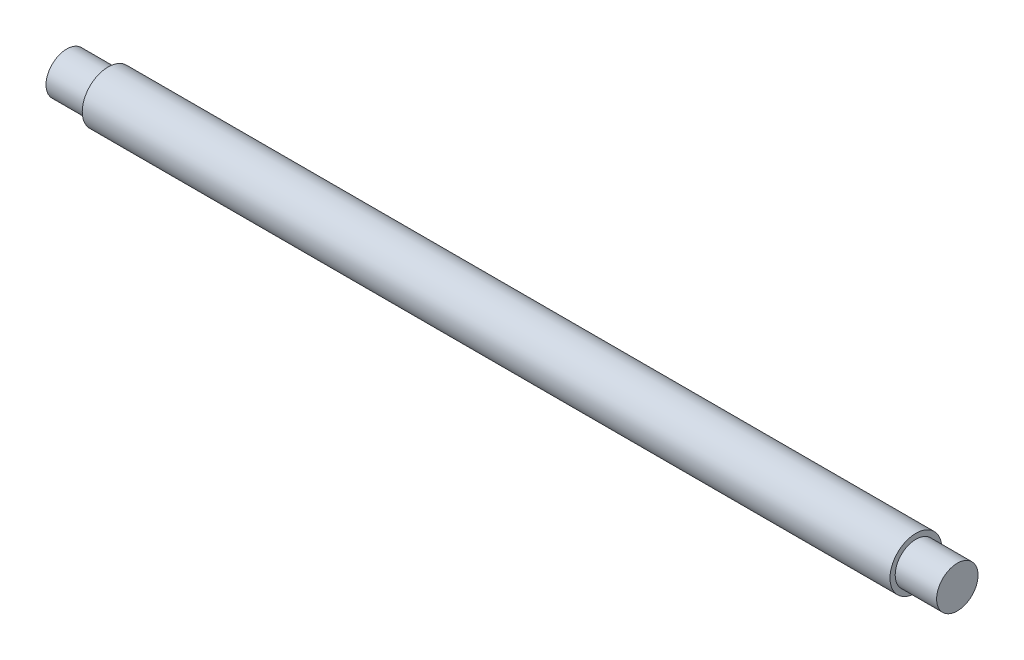
ISO-10303-21;
HEADER;
FILE_DESCRIPTION(('STEP AP214'),'2;1');
FILE_NAME('part.step','',(''),(''),'','','');
FILE_SCHEMA(('AUTOMOTIVE_DESIGN { 1 0 10303 214 1 1 1 1 }'));
ENDSEC;
DATA;
#1=APPLICATION_CONTEXT('core data for automotive mechanical design processes');
#2=APPLICATION_PROTOCOL_DEFINITION('international standard','automotive_design',2000,#1);
#3=PRODUCT_CONTEXT('',#1,'mechanical');
#4=PRODUCT('Part','Part','',(#3));
#5=PRODUCT_RELATED_PRODUCT_CATEGORY('part','',(#4));
#6=PRODUCT_DEFINITION_FORMATION('','',#4);
#7=PRODUCT_DEFINITION_CONTEXT('part definition',#1,'design');
#8=PRODUCT_DEFINITION('design','',#6,#7);
#9=PRODUCT_DEFINITION_SHAPE('','',#8);
#10=(LENGTH_UNIT() NAMED_UNIT(*) SI_UNIT(.MILLI.,.METRE.));
#11=(NAMED_UNIT(*) PLANE_ANGLE_UNIT() SI_UNIT($,.RADIAN.));
#12=(NAMED_UNIT(*) SI_UNIT($,.STERADIAN.) SOLID_ANGLE_UNIT());
#13=UNCERTAINTY_MEASURE_WITH_UNIT(LENGTH_MEASURE(1.E-05),#10,'distance_accuracy_value','');
#14=(GEOMETRIC_REPRESENTATION_CONTEXT(3) GLOBAL_UNCERTAINTY_ASSIGNED_CONTEXT((#13)) GLOBAL_UNIT_ASSIGNED_CONTEXT((#10,
#11,#12)) REPRESENTATION_CONTEXT('',''));
#15=CARTESIAN_POINT('',(0.,0.,0.));
#16=DIRECTION('',(0.,0.,1.));
#17=DIRECTION('',(1.,0.,0.));
#18=AXIS2_PLACEMENT_3D('',#15,#16,#17);
#19=CARTESIAN_POINT('',(0.,0.,0.));
#20=DIRECTION('',(1.,0.,0.));
#21=DIRECTION('',(0.,0.,-1.));
#22=AXIS2_PLACEMENT_3D('',#19,#20,#21);
#23=PLANE('',#22);
#24=CARTESIAN_POINT('',(0.,0.,0.));
#25=DIRECTION('',(-1.,0.,0.));
#26=DIRECTION('',(0.,0.,1.));
#27=AXIS2_PLACEMENT_3D('',#24,#25,#26);
#28=CIRCLE('',#27,4.);
#29=CARTESIAN_POINT('',(0.,0.,4.));
#30=VERTEX_POINT('',#29);
#31=EDGE_CURVE('E10',#30,#30,#28,.T.);
#32=ORIENTED_EDGE('',*,*,#31,.T.);
#33=EDGE_LOOP('',(#32));
#34=FACE_BOUND('',#33,.T.);
#35=ADVANCED_FACE('F34',(#34),#23,.F.);
#36=CARTESIAN_POINT('',(0.,0.,0.));
#37=DIRECTION('',(-1.,0.,0.));
#38=DIRECTION('',(0.,0.,1.));
#39=AXIS2_PLACEMENT_3D('',#36,#37,#38);
#40=CYLINDRICAL_SURFACE('',#39,4.);
#41=ORIENTED_EDGE('',*,*,#31,.F.);
#42=EDGE_LOOP('',(#41));
#43=FACE_BOUND('',#42,.T.);
#44=CARTESIAN_POINT('',(8.,0.,0.));
#45=DIRECTION('',(-1.,0.,0.));
#46=DIRECTION('',(0.,0.,1.));
#47=AXIS2_PLACEMENT_3D('',#44,#45,#46);
#48=CIRCLE('',#47,4.);
#49=CARTESIAN_POINT('',(8.,0.,4.));
#50=VERTEX_POINT('',#49);
#51=EDGE_CURVE('E40',#50,#50,#48,.T.);
#52=ORIENTED_EDGE('',*,*,#51,.T.);
#53=EDGE_LOOP('',(#52));
#54=FACE_BOUND('',#53,.T.);
#55=ADVANCED_FACE('F72',(#43,#54),#40,.T.);
#56=CARTESIAN_POINT('',(8.,4.,0.));
#57=DIRECTION('',(1.,0.,0.));
#58=DIRECTION('',(0.,0.,-1.));
#59=AXIS2_PLACEMENT_3D('',#56,#57,#58);
#60=PLANE('',#59);
#61=ORIENTED_EDGE('',*,*,#51,.F.);
#62=EDGE_LOOP('',(#61));
#63=FACE_BOUND('',#62,.T.);
#64=CARTESIAN_POINT('',(8.,0.,0.));
#65=DIRECTION('',(-1.,0.,0.));
#66=DIRECTION('',(0.,0.,1.));
#67=AXIS2_PLACEMENT_3D('',#64,#65,#66);
#68=CIRCLE('',#67,5.);
#69=CARTESIAN_POINT('',(8.,0.,5.));
#70=VERTEX_POINT('',#69);
#71=EDGE_CURVE('E44',#70,#70,#68,.T.);
#72=ORIENTED_EDGE('',*,*,#71,.T.);
#73=EDGE_LOOP('',(#72));
#74=FACE_BOUND('',#73,.T.);
#75=ADVANCED_FACE('F76',(#63,#74),#60,.F.);
#76=CARTESIAN_POINT('',(0.,0.,0.));
#77=DIRECTION('',(-1.,0.,0.));
#78=DIRECTION('',(0.,0.,1.));
#79=AXIS2_PLACEMENT_3D('',#76,#77,#78);
#80=CYLINDRICAL_SURFACE('',#79,5.);
#81=ORIENTED_EDGE('',*,*,#71,.F.);
#82=EDGE_LOOP('',(#81));
#83=FACE_BOUND('',#82,.T.);
#84=CARTESIAN_POINT('',(164.,0.,0.));
#85=DIRECTION('',(-1.,0.,0.));
#86=DIRECTION('',(0.,0.,1.));
#87=AXIS2_PLACEMENT_3D('',#84,#85,#86);
#88=CIRCLE('',#87,5.);
#89=CARTESIAN_POINT('',(164.,0.,5.));
#90=VERTEX_POINT('',#89);
#91=EDGE_CURVE('E48',#90,#90,#88,.T.);
#92=ORIENTED_EDGE('',*,*,#91,.T.);
#93=EDGE_LOOP('',(#92));
#94=FACE_BOUND('',#93,.T.);
#95=ADVANCED_FACE('F81',(#83,#94),#80,.T.);
#96=CARTESIAN_POINT('',(164.,5.,0.));
#97=DIRECTION('',(-1.,0.,0.));
#98=DIRECTION('',(0.,0.,1.));
#99=AXIS2_PLACEMENT_3D('',#96,#97,#98);
#100=PLANE('',#99);
#101=ORIENTED_EDGE('',*,*,#91,.F.);
#102=EDGE_LOOP('',(#101));
#103=FACE_BOUND('',#102,.T.);
#104=CARTESIAN_POINT('',(164.,0.,0.));
#105=DIRECTION('',(-1.,0.,0.));
#106=DIRECTION('',(0.,0.,1.));
#107=AXIS2_PLACEMENT_3D('',#104,#105,#106);
#108=CIRCLE('',#107,4.);
#109=CARTESIAN_POINT('',(164.,0.,4.));
#110=VERTEX_POINT('',#109);
#111=EDGE_CURVE('E53',#110,#110,#108,.T.);
#112=ORIENTED_EDGE('',*,*,#111,.T.);
#113=EDGE_LOOP('',(#112));
#114=FACE_BOUND('',#113,.T.);
#115=ADVANCED_FACE('F68',(#103,#114),#100,.F.);
#116=CARTESIAN_POINT('',(0.,0.,0.));
#117=DIRECTION('',(-1.,0.,0.));
#118=DIRECTION('',(0.,0.,1.));
#119=AXIS2_PLACEMENT_3D('',#116,#117,#118);
#120=CYLINDRICAL_SURFACE('',#119,4.);
#121=ORIENTED_EDGE('',*,*,#111,.F.);
#122=EDGE_LOOP('',(#121));
#123=FACE_BOUND('',#122,.T.);
#124=CARTESIAN_POINT('',(172.,0.,0.));
#125=DIRECTION('',(-1.,0.,0.));
#126=DIRECTION('',(0.,0.,1.));
#127=AXIS2_PLACEMENT_3D('',#124,#125,#126);
#128=CIRCLE('',#127,4.);
#129=CARTESIAN_POINT('',(172.,0.,4.));
#130=VERTEX_POINT('',#129);
#131=EDGE_CURVE('E56',#130,#130,#128,.T.);
#132=ORIENTED_EDGE('',*,*,#131,.T.);
#133=EDGE_LOOP('',(#132));
#134=FACE_BOUND('',#133,.T.);
#135=ADVANCED_FACE('F60',(#123,#134),#120,.T.);
#136=CARTESIAN_POINT('',(172.,4.,0.));
#137=DIRECTION('',(-1.,0.,0.));
#138=DIRECTION('',(0.,0.,1.));
#139=AXIS2_PLACEMENT_3D('',#136,#137,#138);
#140=PLANE('',#139);
#141=ORIENTED_EDGE('',*,*,#131,.F.);
#142=EDGE_LOOP('',(#141));
#143=FACE_BOUND('',#142,.T.);
#144=ADVANCED_FACE('F62',(#143),#140,.F.);
#145=CLOSED_SHELL('',(#35,#55,#75,#95,#115,#135,#144));
#146=MANIFOLD_SOLID_BREP('B2',#145);
#147=ADVANCED_BREP_SHAPE_REPRESENTATION('',(#18,#146),#14);
#148=SHAPE_DEFINITION_REPRESENTATION(#9,#147);
ENDSEC;
END-ISO-10303-21;
